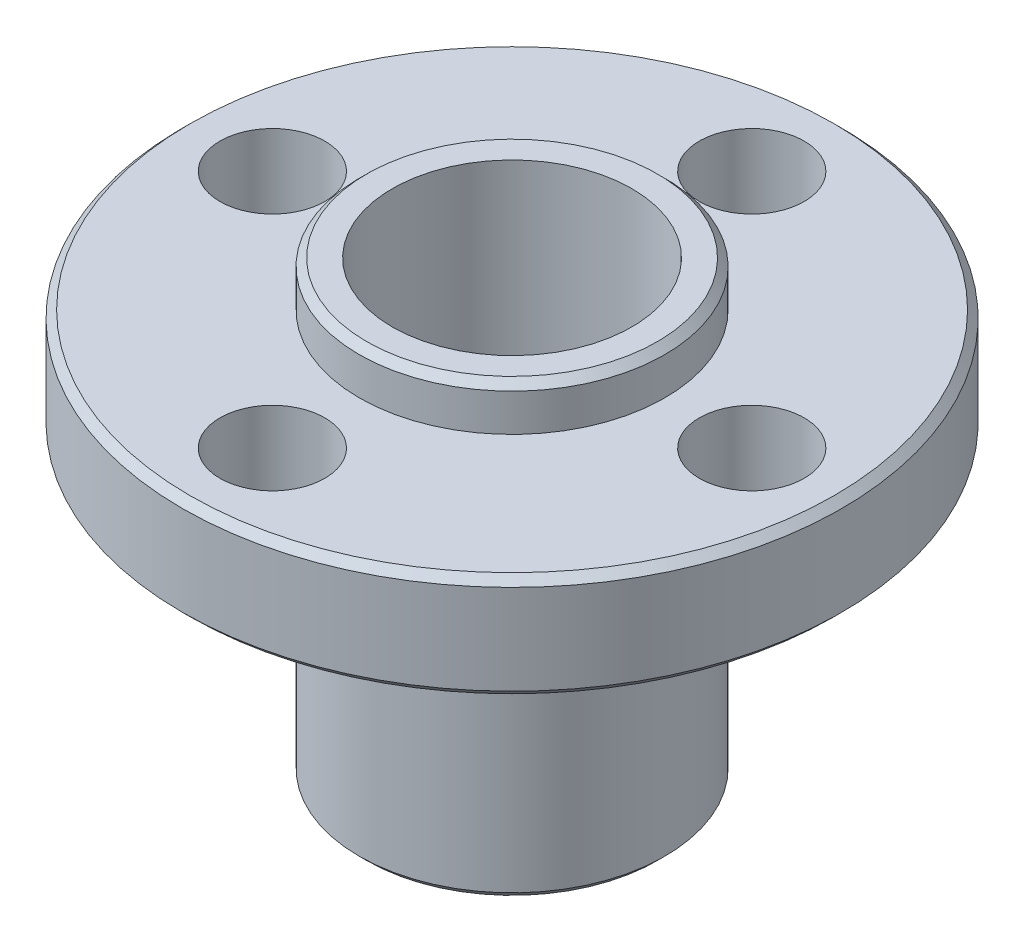
ISO-10303-21;
HEADER;
FILE_DESCRIPTION(('STEP AP214'),'2;1');
FILE_NAME('part.step','',(''),(''),'','','');
FILE_SCHEMA(('AUTOMOTIVE_DESIGN { 1 0 10303 214 1 1 1 1 }'));
ENDSEC;
DATA;
#1=APPLICATION_CONTEXT('core data for automotive mechanical design processes');
#2=APPLICATION_PROTOCOL_DEFINITION('international standard','automotive_design',2000,#1);
#3=PRODUCT_CONTEXT('',#1,'mechanical');
#4=PRODUCT('Part','Part','',(#3));
#5=PRODUCT_RELATED_PRODUCT_CATEGORY('part','',(#4));
#6=PRODUCT_DEFINITION_FORMATION('','',#4);
#7=PRODUCT_DEFINITION_CONTEXT('part definition',#1,'design');
#8=PRODUCT_DEFINITION('design','',#6,#7);
#9=PRODUCT_DEFINITION_SHAPE('','',#8);
#10=(LENGTH_UNIT() NAMED_UNIT(*) SI_UNIT(.MILLI.,.METRE.));
#11=(NAMED_UNIT(*) PLANE_ANGLE_UNIT() SI_UNIT($,.RADIAN.));
#12=(NAMED_UNIT(*) SI_UNIT($,.STERADIAN.) SOLID_ANGLE_UNIT());
#13=UNCERTAINTY_MEASURE_WITH_UNIT(LENGTH_MEASURE(1.E-05),#10,'distance_accuracy_value','');
#14=(GEOMETRIC_REPRESENTATION_CONTEXT(3) GLOBAL_UNCERTAINTY_ASSIGNED_CONTEXT((#13)) GLOBAL_UNIT_ASSIGNED_CONTEXT((#10,
#11,#12)) REPRESENTATION_CONTEXT('',''));
#15=CARTESIAN_POINT('',(0.,0.,0.));
#16=DIRECTION('',(0.,0.,1.));
#17=DIRECTION('',(1.,0.,0.));
#18=AXIS2_PLACEMENT_3D('',#15,#16,#17);
#19=CARTESIAN_POINT('',(0.,1.75,0.));
#20=DIRECTION('',(0.,1.,0.));
#21=DIRECTION('',(0.,0.,1.));
#22=AXIS2_PLACEMENT_3D('',#19,#20,#21);
#23=PLANE('',#22);
#24=CARTESIAN_POINT('',(0.,1.75,0.));
#25=DIRECTION('',(0.,1.,0.));
#26=DIRECTION('',(0.,0.,1.));
#27=AXIS2_PLACEMENT_3D('',#24,#25,#26);
#28=CIRCLE('',#27,10.75);
#29=CARTESIAN_POINT('',(0.,1.75,10.75));
#30=VERTEX_POINT('',#29);
#31=EDGE_CURVE('E84',#30,#30,#28,.T.);
#32=ORIENTED_EDGE('',*,*,#31,.T.);
#33=EDGE_LOOP('',(#32));
#34=FACE_BOUND('',#33,.T.);
#35=CARTESIAN_POINT('',(0.,1.75,8.));
#36=DIRECTION('',(0.,1.,0.));
#37=DIRECTION('',(0.,0.,1.));
#38=AXIS2_PLACEMENT_3D('',#35,#36,#37);
#39=CIRCLE('',#38,1.75);
#40=CARTESIAN_POINT('',(0.,1.75,9.75));
#41=VERTEX_POINT('',#40);
#42=EDGE_CURVE('E118',#41,#41,#39,.T.);
#43=ORIENTED_EDGE('',*,*,#42,.F.);
#44=EDGE_LOOP('',(#43));
#45=FACE_BOUND('',#44,.T.);
#46=CARTESIAN_POINT('',(0.,1.75,-8.));
#47=DIRECTION('',(0.,1.,0.));
#48=DIRECTION('',(0.,0.,1.));
#49=AXIS2_PLACEMENT_3D('',#46,#47,#48);
#50=CIRCLE('',#49,1.75);
#51=CARTESIAN_POINT('',(0.,1.75,-6.25));
#52=VERTEX_POINT('',#51);
#53=EDGE_CURVE('E108',#52,#52,#50,.T.);
#54=ORIENTED_EDGE('',*,*,#53,.F.);
#55=EDGE_LOOP('',(#54));
#56=FACE_BOUND('',#55,.T.);
#57=CARTESIAN_POINT('',(0.,1.75,0.));
#58=DIRECTION('',(0.,1.,0.));
#59=DIRECTION('',(0.,0.,1.));
#60=AXIS2_PLACEMENT_3D('',#57,#58,#59);
#61=CIRCLE('',#60,5.1);
#62=CARTESIAN_POINT('',(0.,1.75,5.1));
#63=VERTEX_POINT('',#62);
#64=EDGE_CURVE('E105',#63,#63,#61,.T.);
#65=ORIENTED_EDGE('',*,*,#64,.F.);
#66=EDGE_LOOP('',(#65));
#67=FACE_BOUND('',#66,.T.);
#68=CARTESIAN_POINT('',(8.,1.75,0.));
#69=DIRECTION('',(0.,1.,0.));
#70=DIRECTION('',(0.,0.,1.));
#71=AXIS2_PLACEMENT_3D('',#68,#69,#70);
#72=CIRCLE('',#71,1.75);
#73=CARTESIAN_POINT('',(8.,1.75,1.75));
#74=VERTEX_POINT('',#73);
#75=EDGE_CURVE('E112',#74,#74,#72,.T.);
#76=ORIENTED_EDGE('',*,*,#75,.F.);
#77=EDGE_LOOP('',(#76));
#78=FACE_BOUND('',#77,.T.);
#79=CARTESIAN_POINT('',(-8.,1.75,0.));
#80=DIRECTION('',(0.,1.,0.));
#81=DIRECTION('',(0.,0.,1.));
#82=AXIS2_PLACEMENT_3D('',#79,#80,#81);
#83=CIRCLE('',#82,1.75);
#84=CARTESIAN_POINT('',(-8.,1.75,1.75));
#85=VERTEX_POINT('',#84);
#86=EDGE_CURVE('E124',#85,#85,#83,.T.);
#87=ORIENTED_EDGE('',*,*,#86,.F.);
#88=EDGE_LOOP('',(#87));
#89=FACE_BOUND('',#88,.T.);
#90=ADVANCED_FACE('F73',(#34,#45,#56,#67,#78,#89),#23,.T.);
#91=CARTESIAN_POINT('',(0.,-1.75,0.));
#92=DIRECTION('',(0.,1.,0.));
#93=DIRECTION('',(0.,0.,1.));
#94=AXIS2_PLACEMENT_3D('',#91,#92,#93);
#95=PLANE('',#94);
#96=CARTESIAN_POINT('',(0.,-1.75,0.));
#97=DIRECTION('',(0.,1.,0.));
#98=DIRECTION('',(0.,0.,1.));
#99=AXIS2_PLACEMENT_3D('',#96,#97,#98);
#100=CIRCLE('',#99,10.75);
#101=CARTESIAN_POINT('',(0.,-1.75,10.75));
#102=VERTEX_POINT('',#101);
#103=EDGE_CURVE('E88',#102,#102,#100,.F.);
#104=ORIENTED_EDGE('',*,*,#103,.T.);
#105=EDGE_LOOP('',(#104));
#106=FACE_BOUND('',#105,.T.);
#107=CARTESIAN_POINT('',(0.,-1.75,0.));
#108=DIRECTION('',(0.,1.,0.));
#109=DIRECTION('',(0.,0.,1.));
#110=AXIS2_PLACEMENT_3D('',#107,#108,#109);
#111=CIRCLE('',#110,5.1);
#112=CARTESIAN_POINT('',(0.,-1.75,5.1));
#113=VERTEX_POINT('',#112);
#114=EDGE_CURVE('E130',#113,#113,#111,.T.);
#115=ORIENTED_EDGE('',*,*,#114,.T.);
#116=EDGE_LOOP('',(#115));
#117=FACE_BOUND('',#116,.T.);
#118=CARTESIAN_POINT('',(0.,-1.75,-8.));
#119=DIRECTION('',(0.,1.,0.));
#120=DIRECTION('',(0.,0.,1.));
#121=AXIS2_PLACEMENT_3D('',#118,#119,#120);
#122=CIRCLE('',#121,1.75);
#123=CARTESIAN_POINT('',(0.,-1.75,-6.25));
#124=VERTEX_POINT('',#123);
#125=EDGE_CURVE('E109',#124,#124,#122,.T.);
#126=ORIENTED_EDGE('',*,*,#125,.T.);
#127=EDGE_LOOP('',(#126));
#128=FACE_BOUND('',#127,.T.);
#129=CARTESIAN_POINT('',(8.,-1.75,0.));
#130=DIRECTION('',(0.,1.,0.));
#131=DIRECTION('',(0.,0.,1.));
#132=AXIS2_PLACEMENT_3D('',#129,#130,#131);
#133=CIRCLE('',#132,1.75);
#134=CARTESIAN_POINT('',(8.,-1.75,1.75));
#135=VERTEX_POINT('',#134);
#136=EDGE_CURVE('E115',#135,#135,#133,.T.);
#137=ORIENTED_EDGE('',*,*,#136,.T.);
#138=EDGE_LOOP('',(#137));
#139=FACE_BOUND('',#138,.T.);
#140=CARTESIAN_POINT('',(0.,-1.75,8.));
#141=DIRECTION('',(0.,1.,0.));
#142=DIRECTION('',(0.,0.,1.));
#143=AXIS2_PLACEMENT_3D('',#140,#141,#142);
#144=CIRCLE('',#143,1.75);
#145=CARTESIAN_POINT('',(0.,-1.75,9.75));
#146=VERTEX_POINT('',#145);
#147=EDGE_CURVE('E121',#146,#146,#144,.T.);
#148=ORIENTED_EDGE('',*,*,#147,.T.);
#149=EDGE_LOOP('',(#148));
#150=FACE_BOUND('',#149,.T.);
#151=CARTESIAN_POINT('',(-8.,-1.75,0.));
#152=DIRECTION('',(0.,1.,0.));
#153=DIRECTION('',(0.,0.,1.));
#154=AXIS2_PLACEMENT_3D('',#151,#152,#153);
#155=CIRCLE('',#154,1.75);
#156=CARTESIAN_POINT('',(-8.,-1.75,1.75));
#157=VERTEX_POINT('',#156);
#158=EDGE_CURVE('E127',#157,#157,#155,.T.);
#159=ORIENTED_EDGE('',*,*,#158,.T.);
#160=EDGE_LOOP('',(#159));
#161=FACE_BOUND('',#160,.T.);
#162=ADVANCED_FACE('F159',(#106,#117,#128,#139,#150,#161),#95,.F.);
#163=CARTESIAN_POINT('',(0.,1.75,0.));
#164=DIRECTION('',(0.,-1.,0.));
#165=DIRECTION('',(0.,0.,-1.));
#166=AXIS2_PLACEMENT_3D('',#163,#164,#165);
#167=CYLINDRICAL_SURFACE('',#166,11.);
#168=CARTESIAN_POINT('',(0.,-1.5,0.));
#169=DIRECTION('',(0.,1.,0.));
#170=DIRECTION('',(0.,0.,1.));
#171=AXIS2_PLACEMENT_3D('',#168,#169,#170);
#172=CIRCLE('',#171,11.);
#173=CARTESIAN_POINT('',(0.,-1.5,11.));
#174=VERTEX_POINT('',#173);
#175=EDGE_CURVE('E93',#174,#174,#172,.T.);
#176=ORIENTED_EDGE('',*,*,#175,.T.);
#177=EDGE_LOOP('',(#176));
#178=FACE_BOUND('',#177,.T.);
#179=CARTESIAN_POINT('',(0.,1.5,0.));
#180=DIRECTION('',(0.,1.,0.));
#181=DIRECTION('',(0.,0.,1.));
#182=AXIS2_PLACEMENT_3D('',#179,#180,#181);
#183=CIRCLE('',#182,11.);
#184=CARTESIAN_POINT('',(0.,1.5,11.));
#185=VERTEX_POINT('',#184);
#186=EDGE_CURVE('E96',#185,#185,#183,.F.);
#187=ORIENTED_EDGE('',*,*,#186,.T.);
#188=EDGE_LOOP('',(#187));
#189=FACE_BOUND('',#188,.T.);
#190=ADVANCED_FACE('F165',(#178,#189),#167,.T.);
#191=CARTESIAN_POINT('',(0.,1.75,-8.));
#192=DIRECTION('',(0.,-1.,0.));
#193=DIRECTION('',(0.,0.,-1.));
#194=AXIS2_PLACEMENT_3D('',#191,#192,#193);
#195=CYLINDRICAL_SURFACE('',#194,1.75);
#196=ORIENTED_EDGE('',*,*,#53,.T.);
#197=EDGE_LOOP('',(#196));
#198=FACE_BOUND('',#197,.T.);
#199=ORIENTED_EDGE('',*,*,#125,.F.);
#200=EDGE_LOOP('',(#199));
#201=FACE_BOUND('',#200,.T.);
#202=ADVANCED_FACE('F170',(#198,#201),#195,.F.);
#203=CARTESIAN_POINT('',(8.,1.75,0.));
#204=DIRECTION('',(0.,-1.,0.));
#205=DIRECTION('',(0.,0.,-1.));
#206=AXIS2_PLACEMENT_3D('',#203,#204,#205);
#207=CYLINDRICAL_SURFACE('',#206,1.75);
#208=ORIENTED_EDGE('',*,*,#75,.T.);
#209=EDGE_LOOP('',(#208));
#210=FACE_BOUND('',#209,.T.);
#211=ORIENTED_EDGE('',*,*,#136,.F.);
#212=EDGE_LOOP('',(#211));
#213=FACE_BOUND('',#212,.T.);
#214=ADVANCED_FACE('F283',(#210,#213),#207,.F.);
#215=CARTESIAN_POINT('',(0.,1.75,8.));
#216=DIRECTION('',(0.,-1.,0.));
#217=DIRECTION('',(0.,0.,-1.));
#218=AXIS2_PLACEMENT_3D('',#215,#216,#217);
#219=CYLINDRICAL_SURFACE('',#218,1.75);
#220=ORIENTED_EDGE('',*,*,#42,.T.);
#221=EDGE_LOOP('',(#220));
#222=FACE_BOUND('',#221,.T.);
#223=ORIENTED_EDGE('',*,*,#147,.F.);
#224=EDGE_LOOP('',(#223));
#225=FACE_BOUND('',#224,.T.);
#226=ADVANCED_FACE('F273',(#222,#225),#219,.F.);
#227=CARTESIAN_POINT('',(-8.,1.75,0.));
#228=DIRECTION('',(0.,-1.,0.));
#229=DIRECTION('',(0.,0.,-1.));
#230=AXIS2_PLACEMENT_3D('',#227,#228,#229);
#231=CYLINDRICAL_SURFACE('',#230,1.75);
#232=ORIENTED_EDGE('',*,*,#86,.T.);
#233=EDGE_LOOP('',(#232));
#234=FACE_BOUND('',#233,.T.);
#235=ORIENTED_EDGE('',*,*,#158,.F.);
#236=EDGE_LOOP('',(#235));
#237=FACE_BOUND('',#236,.T.);
#238=ADVANCED_FACE('F241',(#234,#237),#231,.F.);
#239=CARTESIAN_POINT('',(0.,-11.75,0.));
#240=DIRECTION('',(0.,1.,0.));
#241=DIRECTION('',(0.,0.,1.));
#242=AXIS2_PLACEMENT_3D('',#239,#240,#241);
#243=CYLINDRICAL_SURFACE('',#242,5.1);
#244=CARTESIAN_POINT('',(0.,-11.5,0.));
#245=DIRECTION('',(0.,1.,0.));
#246=DIRECTION('',(0.,0.,1.));
#247=AXIS2_PLACEMENT_3D('',#244,#245,#246);
#248=CIRCLE('',#247,5.1);
#249=CARTESIAN_POINT('',(0.,-11.5,5.1));
#250=VERTEX_POINT('',#249);
#251=EDGE_CURVE('E102',#250,#250,#248,.T.);
#252=ORIENTED_EDGE('',*,*,#251,.T.);
#253=EDGE_LOOP('',(#252));
#254=FACE_BOUND('',#253,.T.);
#255=ORIENTED_EDGE('',*,*,#114,.F.);
#256=EDGE_LOOP('',(#255));
#257=FACE_BOUND('',#256,.T.);
#258=ADVANCED_FACE('F232',(#254,#257),#243,.T.);
#259=CARTESIAN_POINT('',(0.,3.,0.));
#260=DIRECTION('',(0.,1.,0.));
#261=DIRECTION('',(0.,0.,1.));
#262=AXIS2_PLACEMENT_3D('',#259,#260,#261);
#263=CIRCLE('',#262,5.1);
#264=CARTESIAN_POINT('',(0.,3.,5.1));
#265=VERTEX_POINT('',#264);
#266=EDGE_CURVE('E11',#265,#265,#263,.F.);
#267=ORIENTED_EDGE('',*,*,#266,.T.);
#268=EDGE_LOOP('',(#267));
#269=FACE_BOUND('',#268,.T.);
#270=ORIENTED_EDGE('',*,*,#64,.T.);
#271=EDGE_LOOP('',(#270));
#272=FACE_BOUND('',#271,.T.);
#273=ADVANCED_FACE('F222',(#269,#272),#243,.T.);
#274=CARTESIAN_POINT('',(0.,-11.75,0.));
#275=DIRECTION('',(0.,1.,0.));
#276=DIRECTION('',(0.,0.,1.));
#277=AXIS2_PLACEMENT_3D('',#274,#275,#276);
#278=PLANE('',#277);
#279=CARTESIAN_POINT('',(0.,-11.75,0.));
#280=DIRECTION('',(0.,1.,0.));
#281=DIRECTION('',(0.,0.,1.));
#282=AXIS2_PLACEMENT_3D('',#279,#280,#281);
#283=CIRCLE('',#282,4.85);
#284=CARTESIAN_POINT('',(0.,-11.75,4.85));
#285=VERTEX_POINT('',#284);
#286=EDGE_CURVE('E99',#285,#285,#283,.F.);
#287=ORIENTED_EDGE('',*,*,#286,.T.);
#288=EDGE_LOOP('',(#287));
#289=FACE_BOUND('',#288,.T.);
#290=CARTESIAN_POINT('',(0.,-11.75,0.));
#291=DIRECTION('',(0.,1.,0.));
#292=DIRECTION('',(0.,0.,1.));
#293=AXIS2_PLACEMENT_3D('',#290,#291,#292);
#294=CIRCLE('',#293,4.);
#295=CARTESIAN_POINT('',(0.,-11.75,4.));
#296=VERTEX_POINT('',#295);
#297=EDGE_CURVE('E135',#296,#296,#294,.T.);
#298=ORIENTED_EDGE('',*,*,#297,.T.);
#299=EDGE_LOOP('',(#298));
#300=FACE_BOUND('',#299,.T.);
#301=ADVANCED_FACE('F155',(#289,#300),#278,.F.);
#302=CARTESIAN_POINT('',(0.,-11.75,0.));
#303=DIRECTION('',(0.,1.,0.));
#304=DIRECTION('',(0.,0.,1.));
#305=AXIS2_PLACEMENT_3D('',#302,#303,#304);
#306=CYLINDRICAL_SURFACE('',#305,4.);
#307=ORIENTED_EDGE('',*,*,#297,.F.);
#308=EDGE_LOOP('',(#307));
#309=FACE_BOUND('',#308,.T.);
#310=CARTESIAN_POINT('',(0.,3.25,0.));
#311=DIRECTION('',(0.,1.,0.));
#312=DIRECTION('',(0.,0.,1.));
#313=AXIS2_PLACEMENT_3D('',#310,#311,#312);
#314=CIRCLE('',#313,4.);
#315=CARTESIAN_POINT('',(0.,3.25,4.));
#316=VERTEX_POINT('',#315);
#317=EDGE_CURVE('E138',#316,#316,#314,.T.);
#318=ORIENTED_EDGE('',*,*,#317,.T.);
#319=EDGE_LOOP('',(#318));
#320=FACE_BOUND('',#319,.T.);
#321=ADVANCED_FACE('F142',(#309,#320),#306,.F.);
#322=CARTESIAN_POINT('',(0.,3.25,0.));
#323=DIRECTION('',(0.,1.,0.));
#324=DIRECTION('',(0.,0.,1.));
#325=AXIS2_PLACEMENT_3D('',#322,#323,#324);
#326=PLANE('',#325);
#327=CARTESIAN_POINT('',(0.,3.25,0.));
#328=DIRECTION('',(0.,1.,0.));
#329=DIRECTION('',(0.,0.,1.));
#330=AXIS2_PLACEMENT_3D('',#327,#328,#329);
#331=CIRCLE('',#330,4.85);
#332=CARTESIAN_POINT('',(0.,3.25,4.85));
#333=VERTEX_POINT('',#332);
#334=EDGE_CURVE('E80',#333,#333,#331,.T.);
#335=ORIENTED_EDGE('',*,*,#334,.T.);
#336=EDGE_LOOP('',(#335));
#337=FACE_BOUND('',#336,.T.);
#338=ORIENTED_EDGE('',*,*,#317,.F.);
#339=EDGE_LOOP('',(#338));
#340=FACE_BOUND('',#339,.T.);
#341=ADVANCED_FACE('F144',(#337,#340),#326,.T.);
#342=CARTESIAN_POINT('',(0.,-11.5,0.));
#343=DIRECTION('',(0.,1.,0.));
#344=DIRECTION('',(0.,0.,1.));
#345=AXIS2_PLACEMENT_3D('',#342,#343,#344);
#346=CONICAL_SURFACE('',#345,5.1,0.78539816339745);
#347=ORIENTED_EDGE('',*,*,#286,.F.);
#348=EDGE_LOOP('',(#347));
#349=FACE_BOUND('',#348,.T.);
#350=ORIENTED_EDGE('',*,*,#251,.F.);
#351=EDGE_LOOP('',(#350));
#352=FACE_BOUND('',#351,.T.);
#353=ADVANCED_FACE('F146',(#349,#352),#346,.T.);
#354=CARTESIAN_POINT('',(0.,-1.5,0.));
#355=DIRECTION('',(0.,1.,0.));
#356=DIRECTION('',(0.,0.,1.));
#357=AXIS2_PLACEMENT_3D('',#354,#355,#356);
#358=CONICAL_SURFACE('',#357,11.,0.785398163397452);
#359=ORIENTED_EDGE('',*,*,#103,.F.);
#360=EDGE_LOOP('',(#359));
#361=FACE_BOUND('',#360,.T.);
#362=ORIENTED_EDGE('',*,*,#175,.F.);
#363=EDGE_LOOP('',(#362));
#364=FACE_BOUND('',#363,.T.);
#365=ADVANCED_FACE('F152',(#361,#364),#358,.T.);
#366=CARTESIAN_POINT('',(0.,1.75,0.));
#367=DIRECTION('',(0.,-1.,0.));
#368=DIRECTION('',(0.,0.,-1.));
#369=AXIS2_PLACEMENT_3D('',#366,#367,#368);
#370=CONICAL_SURFACE('',#369,10.75,0.785398163397441);
#371=ORIENTED_EDGE('',*,*,#186,.F.);
#372=EDGE_LOOP('',(#371));
#373=FACE_BOUND('',#372,.T.);
#374=ORIENTED_EDGE('',*,*,#31,.F.);
#375=EDGE_LOOP('',(#374));
#376=FACE_BOUND('',#375,.T.);
#377=ADVANCED_FACE('F177',(#373,#376),#370,.T.);
#378=CARTESIAN_POINT('',(0.,3.25,0.));
#379=DIRECTION('',(0.,-1.,0.));
#380=DIRECTION('',(0.,0.,-1.));
#381=AXIS2_PLACEMENT_3D('',#378,#379,#380);
#382=CONICAL_SURFACE('',#381,4.85,0.785398163397447);
#383=ORIENTED_EDGE('',*,*,#266,.F.);
#384=EDGE_LOOP('',(#383));
#385=FACE_BOUND('',#384,.T.);
#386=ORIENTED_EDGE('',*,*,#334,.F.);
#387=EDGE_LOOP('',(#386));
#388=FACE_BOUND('',#387,.T.);
#389=ADVANCED_FACE('F75',(#385,#388),#382,.T.);
#390=CLOSED_SHELL('',(#90,#162,#190,#202,#214,#226,#238,#258,#273,#301,#321,#341,#353,#365,#377,#389));
#391=MANIFOLD_SOLID_BREP('B2',#390);
#392=ADVANCED_BREP_SHAPE_REPRESENTATION('',(#18,#391),#14);
#393=SHAPE_DEFINITION_REPRESENTATION(#9,#392);
ENDSEC;
END-ISO-10303-21;
